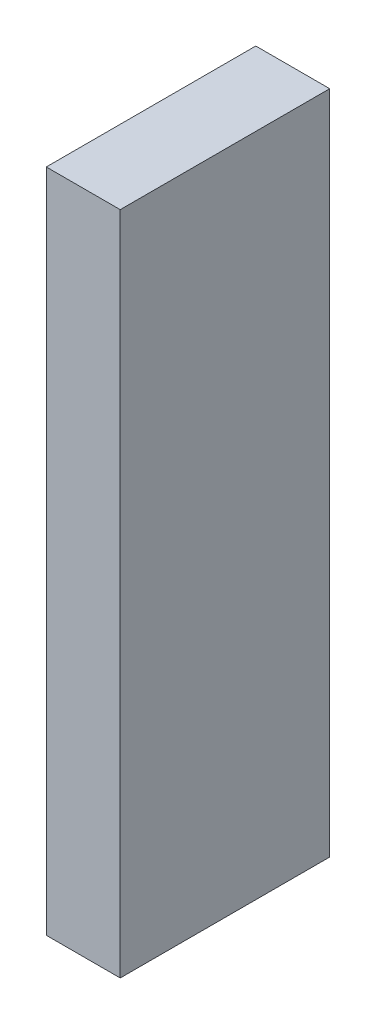
ISO-10303-21;
HEADER;
FILE_DESCRIPTION(('STEP AP214'),'2;1');
FILE_NAME('part.step','',(''),(''),'','','');
FILE_SCHEMA(('AUTOMOTIVE_DESIGN { 1 0 10303 214 1 1 1 1 }'));
ENDSEC;
DATA;
#1=APPLICATION_CONTEXT('core data for automotive mechanical design processes');
#2=APPLICATION_PROTOCOL_DEFINITION('international standard','automotive_design',2000,#1);
#3=PRODUCT_CONTEXT('',#1,'mechanical');
#4=PRODUCT('Part','Part','',(#3));
#5=PRODUCT_RELATED_PRODUCT_CATEGORY('part','',(#4));
#6=PRODUCT_DEFINITION_FORMATION('','',#4);
#7=PRODUCT_DEFINITION_CONTEXT('part definition',#1,'design');
#8=PRODUCT_DEFINITION('design','',#6,#7);
#9=PRODUCT_DEFINITION_SHAPE('','',#8);
#10=(LENGTH_UNIT() NAMED_UNIT(*) SI_UNIT(.MILLI.,.METRE.));
#11=(NAMED_UNIT(*) PLANE_ANGLE_UNIT() SI_UNIT($,.RADIAN.));
#12=(NAMED_UNIT(*) SI_UNIT($,.STERADIAN.) SOLID_ANGLE_UNIT());
#13=UNCERTAINTY_MEASURE_WITH_UNIT(LENGTH_MEASURE(1.E-05),#10,'distance_accuracy_value','');
#14=(GEOMETRIC_REPRESENTATION_CONTEXT(3) GLOBAL_UNCERTAINTY_ASSIGNED_CONTEXT((#13)) GLOBAL_UNIT_ASSIGNED_CONTEXT((#10,
#11,#12)) REPRESENTATION_CONTEXT('',''));
#15=CARTESIAN_POINT('',(0.,0.,0.));
#16=DIRECTION('',(0.,0.,1.));
#17=DIRECTION('',(1.,0.,0.));
#18=AXIS2_PLACEMENT_3D('',#15,#16,#17);
#19=CARTESIAN_POINT('',(-3.0499984943667,2.69998251018302,0.));
#20=DIRECTION('',(-1.,1.19248806385031E-08,0.));
#21=DIRECTION('',(-1.19248806385031E-08,-1.,0.));
#22=AXIS2_PLACEMENT_3D('',#19,#20,#21);
#23=PLANE('',#22);
#24=DIRECTION('',(-1.19248806627069E-08,-1.,0.));
#25=VECTOR('',#24,1.);
#26=CARTESIAN_POINT('',(-3.0499984943667,2.69998251018302,0.));
#27=LINE('',#26,#25);
#28=CARTESIAN_POINT('',(-3.0499984943667,2.69998251018302,0.));
#29=VERTEX_POINT('',#28);
#30=CARTESIAN_POINT('',(-3.04999855876098,-2.70001138630136,0.));
#31=VERTEX_POINT('',#30);
#32=EDGE_CURVE('E11',#29,#31,#27,.T.);
#33=ORIENTED_EDGE('',*,*,#32,.T.);
#34=DIRECTION('',(0.,0.,1.));
#35=VECTOR('',#34,1.);
#36=CARTESIAN_POINT('',(-3.04999855876099,-2.70001138630136,0.));
#37=LINE('',#36,#35);
#38=CARTESIAN_POINT('',(-3.04999855876098,-2.70001138630136,1.6999990940094));
#39=VERTEX_POINT('',#38);
#40=EDGE_CURVE('E88',#31,#39,#37,.T.);
#41=ORIENTED_EDGE('',*,*,#40,.T.);
#42=DIRECTION('',(-1.19248806627069E-08,-1.,0.));
#43=VECTOR('',#42,1.);
#44=CARTESIAN_POINT('',(-3.0499984943667,2.69998251018302,1.6999990940094));
#45=LINE('',#44,#43);
#46=CARTESIAN_POINT('',(-3.0499984943667,2.69998251018302,1.6999990940094));
#47=VERTEX_POINT('',#46);
#48=EDGE_CURVE('E83',#47,#39,#45,.T.);
#49=ORIENTED_EDGE('',*,*,#48,.F.);
#50=DIRECTION('',(0.,0.,1.));
#51=VECTOR('',#50,1.);
#52=CARTESIAN_POINT('',(-3.0499984943667,2.69998251018299,0.));
#53=LINE('',#52,#51);
#54=EDGE_CURVE('E72',#29,#47,#53,.T.);
#55=ORIENTED_EDGE('',*,*,#54,.F.);
#56=EDGE_LOOP('',(#33,#41,#49,#55));
#57=FACE_BOUND('',#56,.T.);
#58=ADVANCED_FACE('F17',(#57),#23,.T.);
#59=CARTESIAN_POINT('',(-3.04999855876098,-2.70001138630136,0.));
#60=DIRECTION('',(-1.19248806385031E-08,-1.,0.));
#61=DIRECTION('',(1.,-1.19248806385031E-08,0.));
#62=AXIS2_PLACEMENT_3D('',#59,#60,#61);
#63=PLANE('',#62);
#64=DIRECTION('',(1.,-1.19248803228865E-08,0.));
#65=VECTOR('',#64,1.);
#66=CARTESIAN_POINT('',(-3.04999855876098,-2.70001138630136,0.));
#67=LINE('',#66,#65);
#68=CARTESIAN_POINT('',(-2.45000008463988,-2.70001139345629,0.));
#69=VERTEX_POINT('',#68);
#70=EDGE_CURVE('E24',#31,#69,#67,.T.);
#71=ORIENTED_EDGE('',*,*,#70,.T.);
#72=DIRECTION('',(0.,0.,1.));
#73=VECTOR('',#72,1.);
#74=CARTESIAN_POINT('',(-2.45000008463988,-2.70001139345627,0.));
#75=LINE('',#74,#73);
#76=CARTESIAN_POINT('',(-2.45000008463988,-2.70001139345629,1.6999990940094));
#77=VERTEX_POINT('',#76);
#78=EDGE_CURVE('E85',#69,#77,#75,.T.);
#79=ORIENTED_EDGE('',*,*,#78,.T.);
#80=DIRECTION('',(1.,-1.19248803228865E-08,0.));
#81=VECTOR('',#80,1.);
#82=CARTESIAN_POINT('',(-3.04999855876098,-2.70001138630136,1.6999990940094));
#83=LINE('',#82,#81);
#84=EDGE_CURVE('E66',#39,#77,#83,.T.);
#85=ORIENTED_EDGE('',*,*,#84,.F.);
#86=ORIENTED_EDGE('',*,*,#40,.F.);
#87=EDGE_LOOP('',(#71,#79,#85,#86));
#88=FACE_BOUND('',#87,.T.);
#89=ADVANCED_FACE('F89',(#88),#63,.T.);
#90=CARTESIAN_POINT('',(-2.45000008463988,-2.70001139345629,0.));
#91=DIRECTION('',(1.,-1.19248806385031E-08,0.));
#92=DIRECTION('',(1.19248806385031E-08,1.,0.));
#93=AXIS2_PLACEMENT_3D('',#90,#91,#92);
#94=PLANE('',#93);
#95=DIRECTION('',(1.19248806627069E-08,1.,0.));
#96=VECTOR('',#95,1.);
#97=CARTESIAN_POINT('',(-2.45000008463988,-2.70001139345629,0.));
#98=LINE('',#97,#96);
#99=CARTESIAN_POINT('',(-2.45000002024561,2.69998250302808,0.));
#100=VERTEX_POINT('',#99);
#101=EDGE_CURVE('E62',#69,#100,#98,.T.);
#102=ORIENTED_EDGE('',*,*,#101,.T.);
#103=DIRECTION('',(0.,0.,1.));
#104=VECTOR('',#103,1.);
#105=CARTESIAN_POINT('',(-2.4500000202456,2.69998250302808,0.));
#106=LINE('',#105,#104);
#107=CARTESIAN_POINT('',(-2.45000002024561,2.69998250302808,1.6999990940094));
#108=VERTEX_POINT('',#107);
#109=EDGE_CURVE('E55',#100,#108,#106,.T.);
#110=ORIENTED_EDGE('',*,*,#109,.T.);
#111=DIRECTION('',(1.19248806627069E-08,1.,0.));
#112=VECTOR('',#111,1.);
#113=CARTESIAN_POINT('',(-2.45000008463988,-2.70001139345629,1.6999990940094));
#114=LINE('',#113,#112);
#115=EDGE_CURVE('E59',#77,#108,#114,.T.);
#116=ORIENTED_EDGE('',*,*,#115,.F.);
#117=ORIENTED_EDGE('',*,*,#78,.F.);
#118=EDGE_LOOP('',(#102,#110,#116,#117));
#119=FACE_BOUND('',#118,.T.);
#120=ADVANCED_FACE('F57',(#119),#94,.T.);
#121=CARTESIAN_POINT('',(-2.45000002024561,2.69998250302808,0.));
#122=DIRECTION('',(1.19248806385031E-08,1.,0.));
#123=DIRECTION('',(-1.,1.19248806385031E-08,0.));
#124=AXIS2_PLACEMENT_3D('',#121,#122,#123);
#125=PLANE('',#124);
#126=DIRECTION('',(-1.,1.19248803228865E-08,0.));
#127=VECTOR('',#126,1.);
#128=CARTESIAN_POINT('',(-2.45000002024561,2.69998250302808,0.));
#129=LINE('',#128,#127);
#130=EDGE_CURVE('E65',#100,#29,#129,.T.);
#131=ORIENTED_EDGE('',*,*,#130,.T.);
#132=ORIENTED_EDGE('',*,*,#54,.T.);
#133=DIRECTION('',(-1.,1.19248803228865E-08,0.));
#134=VECTOR('',#133,1.);
#135=CARTESIAN_POINT('',(-2.45000002024561,2.69998250302808,1.6999990940094));
#136=LINE('',#135,#134);
#137=EDGE_CURVE('E70',#108,#47,#136,.T.);
#138=ORIENTED_EDGE('',*,*,#137,.F.);
#139=ORIENTED_EDGE('',*,*,#109,.F.);
#140=EDGE_LOOP('',(#131,#132,#138,#139));
#141=FACE_BOUND('',#140,.T.);
#142=ADVANCED_FACE('F71',(#141),#125,.T.);
#143=CARTESIAN_POINT('',(65.7749938964844,-379.475006103516,1.6999990940094));
#144=DIRECTION('',(0.,0.,1.));
#145=DIRECTION('',(1.19248806385031E-08,1.,0.));
#146=AXIS2_PLACEMENT_3D('',#143,#144,#145);
#147=PLANE('',#146);
#148=ORIENTED_EDGE('',*,*,#48,.T.);
#149=ORIENTED_EDGE('',*,*,#84,.T.);
#150=ORIENTED_EDGE('',*,*,#115,.T.);
#151=ORIENTED_EDGE('',*,*,#137,.T.);
#152=EDGE_LOOP('',(#148,#149,#150,#151));
#153=FACE_BOUND('',#152,.T.);
#154=ADVANCED_FACE('F76',(#153),#147,.T.);
#155=CARTESIAN_POINT('',(65.7749938964844,-379.475006103516,0.));
#156=DIRECTION('',(0.,0.,1.));
#157=DIRECTION('',(1.19248806385031E-08,1.,0.));
#158=AXIS2_PLACEMENT_3D('',#155,#156,#157);
#159=PLANE('',#158);
#160=ORIENTED_EDGE('',*,*,#130,.F.);
#161=ORIENTED_EDGE('',*,*,#101,.F.);
#162=ORIENTED_EDGE('',*,*,#70,.F.);
#163=ORIENTED_EDGE('',*,*,#32,.F.);
#164=EDGE_LOOP('',(#160,#161,#162,#163));
#165=FACE_BOUND('',#164,.T.);
#166=ADVANCED_FACE('F91',(#165),#159,.F.);
#167=CLOSED_SHELL('',(#58,#89,#120,#142,#154,#166));
#168=MANIFOLD_SOLID_BREP('B1',#167);
#169=ADVANCED_BREP_SHAPE_REPRESENTATION('',(#18,#168),#14);
#170=SHAPE_DEFINITION_REPRESENTATION(#9,#169);
ENDSEC;
END-ISO-10303-21;
